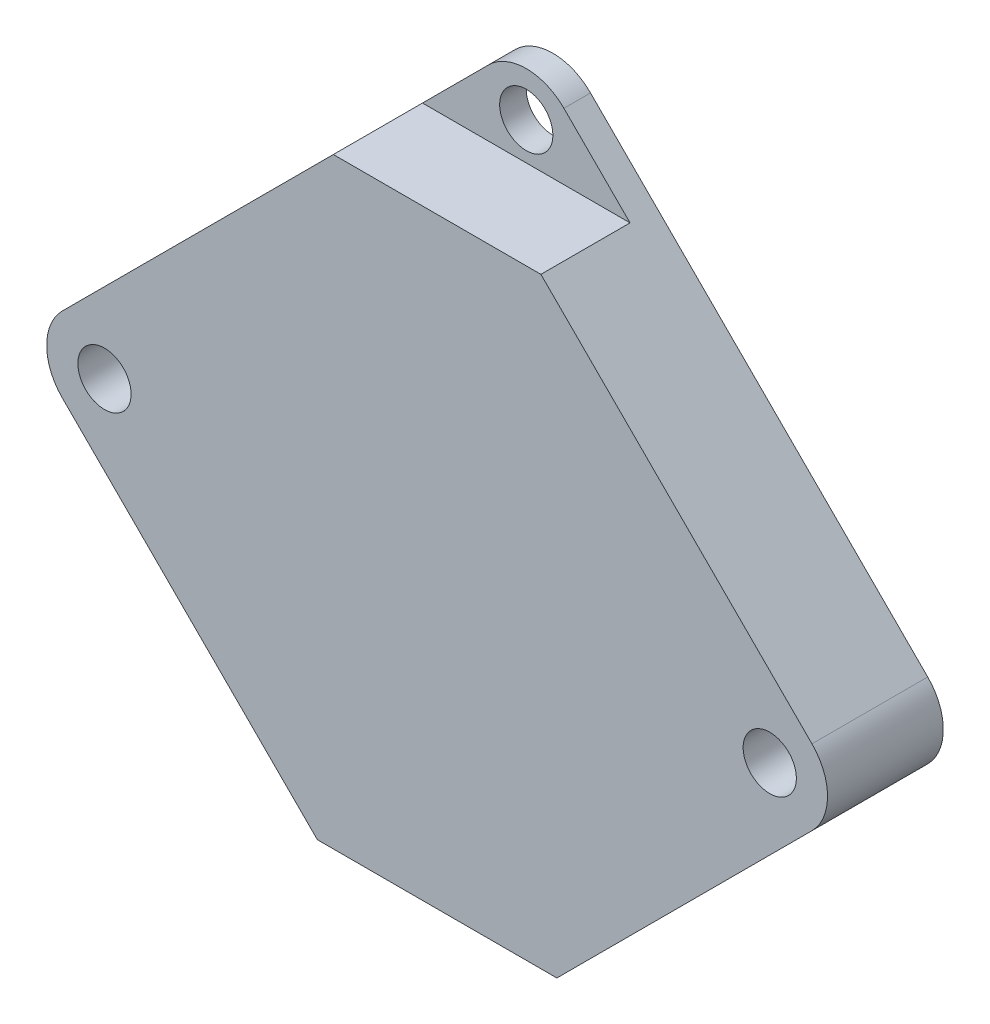
ISO-10303-21;
HEADER;
FILE_DESCRIPTION(('STEP AP214'),'2;1');
FILE_NAME('part.step','',(''),(''),'','','');
FILE_SCHEMA(('AUTOMOTIVE_DESIGN { 1 0 10303 214 1 1 1 1 }'));
ENDSEC;
DATA;
#1=APPLICATION_CONTEXT('core data for automotive mechanical design processes');
#2=APPLICATION_PROTOCOL_DEFINITION('international standard','automotive_design',2000,#1);
#3=PRODUCT_CONTEXT('',#1,'mechanical');
#4=PRODUCT('Part','Part','',(#3));
#5=PRODUCT_RELATED_PRODUCT_CATEGORY('part','',(#4));
#6=PRODUCT_DEFINITION_FORMATION('','',#4);
#7=PRODUCT_DEFINITION_CONTEXT('part definition',#1,'design');
#8=PRODUCT_DEFINITION('design','',#6,#7);
#9=PRODUCT_DEFINITION_SHAPE('','',#8);
#10=(LENGTH_UNIT() NAMED_UNIT(*) SI_UNIT(.MILLI.,.METRE.));
#11=(NAMED_UNIT(*) PLANE_ANGLE_UNIT() SI_UNIT($,.RADIAN.));
#12=(NAMED_UNIT(*) SI_UNIT($,.STERADIAN.) SOLID_ANGLE_UNIT());
#13=UNCERTAINTY_MEASURE_WITH_UNIT(LENGTH_MEASURE(1.E-05),#10,'distance_accuracy_value','');
#14=(GEOMETRIC_REPRESENTATION_CONTEXT(3) GLOBAL_UNCERTAINTY_ASSIGNED_CONTEXT((#13)) GLOBAL_UNIT_ASSIGNED_CONTEXT((#10,
#11,#12)) REPRESENTATION_CONTEXT('',''));
#15=CARTESIAN_POINT('',(0.,0.,0.));
#16=DIRECTION('',(0.,0.,1.));
#17=DIRECTION('',(1.,0.,0.));
#18=AXIS2_PLACEMENT_3D('',#15,#16,#17);
#19=CARTESIAN_POINT('',(0.,13.,4.35));
#20=DIRECTION('',(0.,0.,-1.));
#21=DIRECTION('',(-1.,0.,0.));
#22=AXIS2_PLACEMENT_3D('',#19,#20,#21);
#23=CYLINDRICAL_SURFACE('',#22,1.);
#24=CARTESIAN_POINT('',(0.,13.,0.));
#25=DIRECTION('',(0.,0.,1.));
#26=DIRECTION('',(1.,0.,0.));
#27=AXIS2_PLACEMENT_3D('',#24,#25,#26);
#28=CIRCLE('',#27,1.);
#29=CARTESIAN_POINT('',(1.,13.,0.));
#30=VERTEX_POINT('',#29);
#31=EDGE_CURVE('E438',#30,#30,#28,.T.);
#32=ORIENTED_EDGE('',*,*,#31,.F.);
#33=EDGE_LOOP('',(#32));
#34=FACE_BOUND('',#33,.T.);
#35=CARTESIAN_POINT('',(0.,13.,1.));
#36=DIRECTION('',(0.,0.,1.));
#37=DIRECTION('',(1.,0.,0.));
#38=AXIS2_PLACEMENT_3D('',#35,#36,#37);
#39=CIRCLE('',#38,1.);
#40=CARTESIAN_POINT('',(1.,13.,1.));
#41=VERTEX_POINT('',#40);
#42=EDGE_CURVE('E481',#41,#41,#39,.T.);
#43=ORIENTED_EDGE('',*,*,#42,.T.);
#44=EDGE_LOOP('',(#43));
#45=FACE_BOUND('',#44,.T.);
#46=ADVANCED_FACE('F59',(#34,#45),#23,.F.);
#47=CARTESIAN_POINT('',(0.,12.6715728752538,4.35));
#48=DIRECTION('',(0.,0.,-1.));
#49=DIRECTION('',(-1.,0.,0.));
#50=AXIS2_PLACEMENT_3D('',#47,#48,#49);
#51=CYLINDRICAL_SURFACE('',#50,2.);
#52=DIRECTION('',(0.,0.,-1.));
#53=VECTOR('',#52,1.);
#54=CARTESIAN_POINT('',(-1.41421356237309,14.0857864376269,4.35));
#55=LINE('',#54,#53);
#56=CARTESIAN_POINT('',(-1.4142135623731,14.0857864376269,1.));
#57=VERTEX_POINT('',#56);
#58=CARTESIAN_POINT('',(-1.41421356237309,14.0857864376269,0.));
#59=VERTEX_POINT('',#58);
#60=EDGE_CURVE('E263',#57,#59,#55,.T.);
#61=ORIENTED_EDGE('',*,*,#60,.F.);
#62=CARTESIAN_POINT('',(0.,12.6715728752538,1.));
#63=DIRECTION('',(0.,0.,1.));
#64=DIRECTION('',(1.,0.,0.));
#65=AXIS2_PLACEMENT_3D('',#62,#63,#64);
#66=CIRCLE('',#65,2.);
#67=CARTESIAN_POINT('',(1.4142135623731,14.0857864376269,1.));
#68=VERTEX_POINT('',#67);
#69=EDGE_CURVE('E13',#57,#68,#66,.F.);
#70=ORIENTED_EDGE('',*,*,#69,.T.);
#71=DIRECTION('',(0.,0.,-1.));
#72=VECTOR('',#71,1.);
#73=CARTESIAN_POINT('',(1.4142135623731,14.0857864376269,4.35));
#74=LINE('',#73,#72);
#75=CARTESIAN_POINT('',(1.4142135623731,14.0857864376269,0.));
#76=VERTEX_POINT('',#75);
#77=EDGE_CURVE('E272',#76,#68,#74,.F.);
#78=ORIENTED_EDGE('',*,*,#77,.F.);
#79=CARTESIAN_POINT('',(0.,12.6715728752538,0.));
#80=DIRECTION('',(0.,0.,1.));
#81=DIRECTION('',(1.,0.,0.));
#82=AXIS2_PLACEMENT_3D('',#79,#80,#81);
#83=CIRCLE('',#82,2.);
#84=EDGE_CURVE('E247',#59,#76,#83,.F.);
#85=ORIENTED_EDGE('',*,*,#84,.F.);
#86=EDGE_LOOP('',(#61,#70,#78,#85));
#87=FACE_BOUND('',#86,.T.);
#88=ADVANCED_FACE('F359',(#87),#51,.T.);
#89=CARTESIAN_POINT('',(0.,-15.5,4.35));
#90=DIRECTION('',(-0.707106781186548,0.707106781186547,0.));
#91=DIRECTION('',(-0.707106781186547,-0.707106781186548,0.));
#92=AXIS2_PLACEMENT_3D('',#89,#90,#91);
#93=PLANE('',#92);
#94=DIRECTION('',(0.,0.,-1.));
#95=VECTOR('',#94,1.);
#96=CARTESIAN_POINT('',(4.5,-11.,4.35));
#97=LINE('',#96,#95);
#98=CARTESIAN_POINT('',(4.5,-11.,4.35));
#99=VERTEX_POINT('',#98);
#100=CARTESIAN_POINT('',(4.5,-11.,0.));
#101=VERTEX_POINT('',#100);
#102=EDGE_CURVE('E409',#99,#101,#97,.T.);
#103=ORIENTED_EDGE('',*,*,#102,.T.);
#104=DIRECTION('',(0.707106781186547,0.707106781186548,0.));
#105=VECTOR('',#104,1.);
#106=CARTESIAN_POINT('',(0.,-15.5,0.));
#107=LINE('',#106,#105);
#108=CARTESIAN_POINT('',(14.0857864376269,-1.4142135623731,0.));
#109=VERTEX_POINT('',#108);
#110=EDGE_CURVE('E225',#101,#109,#107,.T.);
#111=ORIENTED_EDGE('',*,*,#110,.T.);
#112=DIRECTION('',(0.,0.,-1.));
#113=VECTOR('',#112,1.);
#114=CARTESIAN_POINT('',(14.0857864376269,-1.4142135623731,4.35));
#115=LINE('',#114,#113);
#116=CARTESIAN_POINT('',(14.0857864376269,-1.4142135623731,4.35));
#117=VERTEX_POINT('',#116);
#118=EDGE_CURVE('E219',#109,#117,#115,.F.);
#119=ORIENTED_EDGE('',*,*,#118,.T.);
#120=DIRECTION('',(0.707106781186547,0.707106781186548,0.));
#121=VECTOR('',#120,1.);
#122=CARTESIAN_POINT('',(0.,-15.5,4.35));
#123=LINE('',#122,#121);
#124=EDGE_CURVE('E221',#99,#117,#123,.T.);
#125=ORIENTED_EDGE('',*,*,#124,.F.);
#126=EDGE_LOOP('',(#103,#111,#119,#125));
#127=FACE_BOUND('',#126,.T.);
#128=ADVANCED_FACE('F365',(#127),#93,.F.);
#129=CARTESIAN_POINT('',(-15.5,0.,4.35));
#130=DIRECTION('',(0.707106781186547,0.707106781186548,0.));
#131=DIRECTION('',(-0.707106781186548,0.707106781186547,0.));
#132=AXIS2_PLACEMENT_3D('',#129,#130,#131);
#133=PLANE('',#132);
#134=DIRECTION('',(0.,0.,-1.));
#135=VECTOR('',#134,1.);
#136=CARTESIAN_POINT('',(-4.5,-11.,4.35));
#137=LINE('',#136,#135);
#138=CARTESIAN_POINT('',(-4.5,-11.,4.35));
#139=VERTEX_POINT('',#138);
#140=CARTESIAN_POINT('',(-4.5,-11.,0.));
#141=VERTEX_POINT('',#140);
#142=EDGE_CURVE('E404',#139,#141,#137,.T.);
#143=ORIENTED_EDGE('',*,*,#142,.F.);
#144=DIRECTION('',(0.707106781186548,-0.707106781186547,0.));
#145=VECTOR('',#144,1.);
#146=CARTESIAN_POINT('',(-15.5,0.,4.35));
#147=LINE('',#146,#145);
#148=CARTESIAN_POINT('',(-14.0857864376269,-1.41421356237309,4.35));
#149=VERTEX_POINT('',#148);
#150=EDGE_CURVE('E214',#149,#139,#147,.T.);
#151=ORIENTED_EDGE('',*,*,#150,.F.);
#152=DIRECTION('',(0.,0.,-1.));
#153=VECTOR('',#152,1.);
#154=CARTESIAN_POINT('',(-14.0857864376269,-1.41421356237309,4.35));
#155=LINE('',#154,#153);
#156=CARTESIAN_POINT('',(-14.0857864376269,-1.41421356237309,0.));
#157=VERTEX_POINT('',#156);
#158=EDGE_CURVE('E253',#149,#157,#155,.T.);
#159=ORIENTED_EDGE('',*,*,#158,.T.);
#160=DIRECTION('',(0.707106781186548,-0.707106781186547,0.));
#161=VECTOR('',#160,1.);
#162=CARTESIAN_POINT('',(-15.5,0.,0.));
#163=LINE('',#162,#161);
#164=EDGE_CURVE('E236',#157,#141,#163,.T.);
#165=ORIENTED_EDGE('',*,*,#164,.T.);
#166=EDGE_LOOP('',(#143,#151,#159,#165));
#167=FACE_BOUND('',#166,.T.);
#168=ADVANCED_FACE('F374',(#167),#133,.F.);
#169=CARTESIAN_POINT('',(0.,0.,4.35));
#170=DIRECTION('',(0.,0.,1.));
#171=DIRECTION('',(1.,0.,0.));
#172=AXIS2_PLACEMENT_3D('',#169,#170,#171);
#173=PLANE('',#172);
#174=DIRECTION('',(1.,0.,0.));
#175=VECTOR('',#174,1.);
#176=CARTESIAN_POINT('',(-3.9,11.6,4.35));
#177=LINE('',#176,#175);
#178=CARTESIAN_POINT('',(-3.9,11.6,4.35));
#179=VERTEX_POINT('',#178);
#180=CARTESIAN_POINT('',(3.9,11.6,4.35));
#181=VERTEX_POINT('',#180);
#182=EDGE_CURVE('E188',#179,#181,#177,.T.);
#183=ORIENTED_EDGE('',*,*,#182,.F.);
#184=DIRECTION('',(-0.707106781186547,-0.707106781186548,0.));
#185=VECTOR('',#184,1.);
#186=CARTESIAN_POINT('',(0.,15.5,4.35));
#187=LINE('',#186,#185);
#188=CARTESIAN_POINT('',(-14.0857864376269,1.4142135623731,4.35));
#189=VERTEX_POINT('',#188);
#190=EDGE_CURVE('E202',#179,#189,#187,.T.);
#191=ORIENTED_EDGE('',*,*,#190,.T.);
#192=CARTESIAN_POINT('',(-12.6715728752538,0.,4.35));
#193=DIRECTION('',(0.,0.,1.));
#194=DIRECTION('',(1.,0.,0.));
#195=AXIS2_PLACEMENT_3D('',#192,#193,#194);
#196=CIRCLE('',#195,2.);
#197=EDGE_CURVE('E260',#189,#149,#196,.T.);
#198=ORIENTED_EDGE('',*,*,#197,.T.);
#199=ORIENTED_EDGE('',*,*,#150,.T.);
#200=DIRECTION('',(-1.,0.,0.));
#201=VECTOR('',#200,1.);
#202=CARTESIAN_POINT('',(0.,-11.,4.35));
#203=LINE('',#202,#201);
#204=EDGE_CURVE('E416',#99,#139,#203,.T.);
#205=ORIENTED_EDGE('',*,*,#204,.F.);
#206=ORIENTED_EDGE('',*,*,#124,.T.);
#207=CARTESIAN_POINT('',(12.6715728752538,0.,4.35));
#208=DIRECTION('',(0.,0.,1.));
#209=DIRECTION('',(1.,0.,0.));
#210=AXIS2_PLACEMENT_3D('',#207,#208,#209);
#211=CIRCLE('',#210,2.);
#212=CARTESIAN_POINT('',(14.0857864376269,1.4142135623731,4.35));
#213=VERTEX_POINT('',#212);
#214=EDGE_CURVE('E257',#117,#213,#211,.T.);
#215=ORIENTED_EDGE('',*,*,#214,.T.);
#216=DIRECTION('',(-0.707106781186548,0.707106781186547,0.));
#217=VECTOR('',#216,1.);
#218=CARTESIAN_POINT('',(15.5,0.,4.35));
#219=LINE('',#218,#217);
#220=EDGE_CURVE('E205',#213,#181,#219,.T.);
#221=ORIENTED_EDGE('',*,*,#220,.T.);
#222=EDGE_LOOP('',(#183,#191,#198,#199,#205,#206,#215,#221));
#223=FACE_BOUND('',#222,.T.);
#224=CARTESIAN_POINT('',(-12.5,0.,4.35));
#225=DIRECTION('',(0.,0.,1.));
#226=DIRECTION('',(1.,0.,0.));
#227=AXIS2_PLACEMENT_3D('',#224,#225,#226);
#228=CIRCLE('',#227,1.);
#229=CARTESIAN_POINT('',(-11.5,0.,4.35));
#230=VERTEX_POINT('',#229);
#231=EDGE_CURVE('E229',#230,#230,#228,.T.);
#232=ORIENTED_EDGE('',*,*,#231,.F.);
#233=EDGE_LOOP('',(#232));
#234=FACE_BOUND('',#233,.T.);
#235=CARTESIAN_POINT('',(12.5,0.,4.35));
#236=DIRECTION('',(0.,0.,1.));
#237=DIRECTION('',(1.,0.,0.));
#238=AXIS2_PLACEMENT_3D('',#235,#236,#237);
#239=CIRCLE('',#238,1.);
#240=CARTESIAN_POINT('',(13.5,0.,4.35));
#241=VERTEX_POINT('',#240);
#242=EDGE_CURVE('E453',#241,#241,#239,.T.);
#243=ORIENTED_EDGE('',*,*,#242,.F.);
#244=EDGE_LOOP('',(#243));
#245=FACE_BOUND('',#244,.T.);
#246=ADVANCED_FACE('F200',(#223,#234,#245),#173,.T.);
#247=CARTESIAN_POINT('',(0.,0.,0.));
#248=DIRECTION('',(0.,0.,1.));
#249=DIRECTION('',(1.,0.,0.));
#250=AXIS2_PLACEMENT_3D('',#247,#248,#249);
#251=PLANE('',#250);
#252=ORIENTED_EDGE('',*,*,#31,.T.);
#253=EDGE_LOOP('',(#252));
#254=FACE_BOUND('',#253,.T.);
#255=CARTESIAN_POINT('',(12.5,0.,0.));
#256=DIRECTION('',(0.,0.,1.));
#257=DIRECTION('',(1.,0.,0.));
#258=AXIS2_PLACEMENT_3D('',#255,#256,#257);
#259=CIRCLE('',#258,1.);
#260=CARTESIAN_POINT('',(13.5,0.,0.));
#261=VERTEX_POINT('',#260);
#262=EDGE_CURVE('E449',#261,#261,#259,.T.);
#263=ORIENTED_EDGE('',*,*,#262,.T.);
#264=EDGE_LOOP('',(#263));
#265=FACE_BOUND('',#264,.T.);
#266=CARTESIAN_POINT('',(-12.5,0.,0.));
#267=DIRECTION('',(0.,0.,1.));
#268=DIRECTION('',(1.,0.,0.));
#269=AXIS2_PLACEMENT_3D('',#266,#267,#268);
#270=CIRCLE('',#269,1.);
#271=CARTESIAN_POINT('',(-11.5,0.,0.));
#272=VERTEX_POINT('',#271);
#273=EDGE_CURVE('E445',#272,#272,#270,.T.);
#274=ORIENTED_EDGE('',*,*,#273,.T.);
#275=EDGE_LOOP('',(#274));
#276=FACE_BOUND('',#275,.T.);
#277=CARTESIAN_POINT('',(0.,7.,0.));
#278=DIRECTION('',(0.,0.,1.));
#279=DIRECTION('',(1.,0.,0.));
#280=AXIS2_PLACEMENT_3D('',#277,#278,#279);
#281=CIRCLE('',#280,4.1);
#282=CARTESIAN_POINT('',(3.29331721297936,9.44214285714286,0.));
#283=VERTEX_POINT('',#282);
#284=CARTESIAN_POINT('',(-3.29331721297936,9.44214285714286,0.));
#285=VERTEX_POINT('',#284);
#286=EDGE_CURVE('E427',#283,#285,#281,.T.);
#287=ORIENTED_EDGE('',*,*,#286,.T.);
#288=CARTESIAN_POINT('',(0.,0.,0.));
#289=DIRECTION('',(0.,0.,1.));
#290=DIRECTION('',(1.,0.,0.));
#291=AXIS2_PLACEMENT_3D('',#288,#289,#290);
#292=CIRCLE('',#291,10.);
#293=EDGE_CURVE('E408',#285,#283,#292,.T.);
#294=ORIENTED_EDGE('',*,*,#293,.T.);
#295=EDGE_LOOP('',(#287,#294));
#296=FACE_BOUND('',#295,.T.);
#297=DIRECTION('',(-1.,0.,0.));
#298=VECTOR('',#297,1.);
#299=CARTESIAN_POINT('',(0.,-11.,0.));
#300=LINE('',#299,#298);
#301=EDGE_CURVE('E419',#101,#141,#300,.T.);
#302=ORIENTED_EDGE('',*,*,#301,.T.);
#303=ORIENTED_EDGE('',*,*,#164,.F.);
#304=CARTESIAN_POINT('',(-12.6715728752538,0.,0.));
#305=DIRECTION('',(0.,0.,1.));
#306=DIRECTION('',(1.,0.,0.));
#307=AXIS2_PLACEMENT_3D('',#304,#305,#306);
#308=CIRCLE('',#307,2.);
#309=CARTESIAN_POINT('',(-14.0857864376269,1.4142135623731,0.));
#310=VERTEX_POINT('',#309);
#311=EDGE_CURVE('E250',#157,#310,#308,.F.);
#312=ORIENTED_EDGE('',*,*,#311,.T.);
#313=DIRECTION('',(-0.707106781186547,-0.707106781186548,0.));
#314=VECTOR('',#313,1.);
#315=CARTESIAN_POINT('',(0.,15.5,0.));
#316=LINE('',#315,#314);
#317=EDGE_CURVE('E233',#59,#310,#316,.T.);
#318=ORIENTED_EDGE('',*,*,#317,.F.);
#319=ORIENTED_EDGE('',*,*,#84,.T.);
#320=DIRECTION('',(-0.707106781186548,0.707106781186547,0.));
#321=VECTOR('',#320,1.);
#322=CARTESIAN_POINT('',(15.5,0.,0.));
#323=LINE('',#322,#321);
#324=CARTESIAN_POINT('',(14.0857864376269,1.4142135623731,0.));
#325=VERTEX_POINT('',#324);
#326=EDGE_CURVE('E228',#325,#76,#323,.T.);
#327=ORIENTED_EDGE('',*,*,#326,.F.);
#328=CARTESIAN_POINT('',(12.6715728752538,0.,0.));
#329=DIRECTION('',(0.,0.,1.));
#330=DIRECTION('',(1.,0.,0.));
#331=AXIS2_PLACEMENT_3D('',#328,#329,#330);
#332=CIRCLE('',#331,2.);
#333=EDGE_CURVE('E243',#325,#109,#332,.F.);
#334=ORIENTED_EDGE('',*,*,#333,.T.);
#335=ORIENTED_EDGE('',*,*,#110,.F.);
#336=EDGE_LOOP('',(#302,#303,#312,#318,#319,#327,#334,#335));
#337=FACE_BOUND('',#336,.T.);
#338=ADVANCED_FACE('F373',(#254,#265,#276,#296,#337),#251,.F.);
#339=CARTESIAN_POINT('',(15.5,0.,4.35));
#340=DIRECTION('',(-0.707106781186547,-0.707106781186548,0.));
#341=DIRECTION('',(0.707106781186548,-0.707106781186547,0.));
#342=AXIS2_PLACEMENT_3D('',#339,#340,#341);
#343=PLANE('',#342);
#344=DIRECTION('',(0.707106781186547,-0.707106781186548,0.));
#345=VECTOR('',#344,1.);
#346=CARTESIAN_POINT('',(3.9,11.6,1.));
#347=LINE('',#346,#345);
#348=CARTESIAN_POINT('',(3.9,11.6,0.999999999999997));
#349=VERTEX_POINT('',#348);
#350=EDGE_CURVE('E75',#68,#349,#347,.T.);
#351=ORIENTED_EDGE('',*,*,#350,.T.);
#352=DIRECTION('',(0.,0.,1.));
#353=VECTOR('',#352,1.);
#354=CARTESIAN_POINT('',(3.9,11.6,-8.72066511224918));
#355=LINE('',#354,#353);
#356=EDGE_CURVE('E196',#349,#181,#355,.T.);
#357=ORIENTED_EDGE('',*,*,#356,.T.);
#358=ORIENTED_EDGE('',*,*,#220,.F.);
#359=DIRECTION('',(0.,0.,-1.));
#360=VECTOR('',#359,1.);
#361=CARTESIAN_POINT('',(14.0857864376269,1.4142135623731,4.35));
#362=LINE('',#361,#360);
#363=EDGE_CURVE('E268',#213,#325,#362,.T.);
#364=ORIENTED_EDGE('',*,*,#363,.T.);
#365=ORIENTED_EDGE('',*,*,#326,.T.);
#366=ORIENTED_EDGE('',*,*,#77,.T.);
#367=EDGE_LOOP('',(#351,#357,#358,#364,#365,#366));
#368=FACE_BOUND('',#367,.T.);
#369=ADVANCED_FACE('F377',(#368),#343,.F.);
#370=CARTESIAN_POINT('',(0.,15.5,4.35));
#371=DIRECTION('',(0.707106781186548,-0.707106781186547,0.));
#372=DIRECTION('',(0.707106781186547,0.707106781186548,0.));
#373=AXIS2_PLACEMENT_3D('',#370,#371,#372);
#374=PLANE('',#373);
#375=ORIENTED_EDGE('',*,*,#190,.F.);
#376=DIRECTION('',(0.,0.,1.));
#377=VECTOR('',#376,1.);
#378=CARTESIAN_POINT('',(-3.9,11.6,-8.72066511224918));
#379=LINE('',#378,#377);
#380=CARTESIAN_POINT('',(-3.9,11.6,1.));
#381=VERTEX_POINT('',#380);
#382=EDGE_CURVE('E185',#381,#179,#379,.T.);
#383=ORIENTED_EDGE('',*,*,#382,.F.);
#384=DIRECTION('',(0.707106781186548,0.707106781186548,0.));
#385=VECTOR('',#384,1.);
#386=CARTESIAN_POINT('',(0.,15.5,1.));
#387=LINE('',#386,#385);
#388=EDGE_CURVE('E472',#381,#57,#387,.T.);
#389=ORIENTED_EDGE('',*,*,#388,.T.);
#390=ORIENTED_EDGE('',*,*,#60,.T.);
#391=ORIENTED_EDGE('',*,*,#317,.T.);
#392=DIRECTION('',(0.,0.,-1.));
#393=VECTOR('',#392,1.);
#394=CARTESIAN_POINT('',(-14.0857864376269,1.4142135623731,4.35));
#395=LINE('',#394,#393);
#396=EDGE_CURVE('E211',#310,#189,#395,.F.);
#397=ORIENTED_EDGE('',*,*,#396,.T.);
#398=EDGE_LOOP('',(#375,#383,#389,#390,#391,#397));
#399=FACE_BOUND('',#398,.T.);
#400=ADVANCED_FACE('F208',(#399),#374,.F.);
#401=CARTESIAN_POINT('',(12.5,0.,4.35));
#402=DIRECTION('',(0.,0.,-1.));
#403=DIRECTION('',(-1.,0.,0.));
#404=AXIS2_PLACEMENT_3D('',#401,#402,#403);
#405=CYLINDRICAL_SURFACE('',#404,1.);
#406=ORIENTED_EDGE('',*,*,#242,.T.);
#407=EDGE_LOOP('',(#406));
#408=FACE_BOUND('',#407,.T.);
#409=ORIENTED_EDGE('',*,*,#262,.F.);
#410=EDGE_LOOP('',(#409));
#411=FACE_BOUND('',#410,.T.);
#412=ADVANCED_FACE('F356',(#408,#411),#405,.F.);
#413=CARTESIAN_POINT('',(-12.5,0.,4.35));
#414=DIRECTION('',(0.,0.,-1.));
#415=DIRECTION('',(-1.,0.,0.));
#416=AXIS2_PLACEMENT_3D('',#413,#414,#415);
#417=CYLINDRICAL_SURFACE('',#416,1.);
#418=ORIENTED_EDGE('',*,*,#231,.T.);
#419=EDGE_LOOP('',(#418));
#420=FACE_BOUND('',#419,.T.);
#421=ORIENTED_EDGE('',*,*,#273,.F.);
#422=EDGE_LOOP('',(#421));
#423=FACE_BOUND('',#422,.T.);
#424=ADVANCED_FACE('F351',(#420,#423),#417,.F.);
#425=CARTESIAN_POINT('',(0.,7.,2.));
#426=DIRECTION('',(0.,0.,-1.));
#427=DIRECTION('',(-1.,0.,0.));
#428=AXIS2_PLACEMENT_3D('',#425,#426,#427);
#429=CYLINDRICAL_SURFACE('',#428,4.1);
#430=ORIENTED_EDGE('',*,*,#286,.F.);
#431=DIRECTION('',(0.,0.,-1.));
#432=VECTOR('',#431,1.);
#433=CARTESIAN_POINT('',(3.29331721297936,9.44214285714286,2.));
#434=LINE('',#433,#432);
#435=CARTESIAN_POINT('',(3.29331721297936,9.44214285714286,2.));
#436=VERTEX_POINT('',#435);
#437=EDGE_CURVE('E434',#436,#283,#434,.T.);
#438=ORIENTED_EDGE('',*,*,#437,.F.);
#439=CARTESIAN_POINT('',(0.,7.,2.));
#440=DIRECTION('',(0.,0.,1.));
#441=DIRECTION('',(1.,0.,0.));
#442=AXIS2_PLACEMENT_3D('',#439,#440,#441);
#443=CIRCLE('',#442,4.1);
#444=CARTESIAN_POINT('',(-3.29331721297936,9.44214285714286,2.));
#445=VERTEX_POINT('',#444);
#446=EDGE_CURVE('E422',#436,#445,#443,.T.);
#447=ORIENTED_EDGE('',*,*,#446,.T.);
#448=DIRECTION('',(0.,0.,-1.));
#449=VECTOR('',#448,1.);
#450=CARTESIAN_POINT('',(-3.29331721297936,9.44214285714286,2.));
#451=LINE('',#450,#449);
#452=EDGE_CURVE('E426',#445,#285,#451,.T.);
#453=ORIENTED_EDGE('',*,*,#452,.T.);
#454=EDGE_LOOP('',(#430,#438,#447,#453));
#455=FACE_BOUND('',#454,.T.);
#456=ADVANCED_FACE('F349',(#455),#429,.F.);
#457=CARTESIAN_POINT('',(0.,0.,2.));
#458=DIRECTION('',(0.,0.,1.));
#459=DIRECTION('',(1.,0.,0.));
#460=AXIS2_PLACEMENT_3D('',#457,#458,#459);
#461=PLANE('',#460);
#462=DIRECTION('',(1.,0.,0.));
#463=VECTOR('',#462,1.);
#464=CARTESIAN_POINT('',(0.,10.2,2.));
#465=LINE('',#464,#463);
#466=CARTESIAN_POINT('',(-1.7,10.2,2.));
#467=VERTEX_POINT('',#466);
#468=CARTESIAN_POINT('',(1.7,10.2,2.));
#469=VERTEX_POINT('',#468);
#470=EDGE_CURVE('E68',#467,#469,#465,.T.);
#471=ORIENTED_EDGE('',*,*,#470,.F.);
#472=DIRECTION('',(0.,-1.,0.));
#473=VECTOR('',#472,1.);
#474=CARTESIAN_POINT('',(-1.7,10.2,2.));
#475=LINE('',#474,#473);
#476=CARTESIAN_POINT('',(-1.7,-9.85444062339411,2.));
#477=VERTEX_POINT('',#476);
#478=EDGE_CURVE('E305',#467,#477,#475,.T.);
#479=ORIENTED_EDGE('',*,*,#478,.T.);
#480=CARTESIAN_POINT('',(0.,0.,2.));
#481=DIRECTION('',(0.,0.,1.));
#482=DIRECTION('',(1.,0.,0.));
#483=AXIS2_PLACEMENT_3D('',#480,#481,#482);
#484=CIRCLE('',#483,10.);
#485=EDGE_CURVE('E431',#445,#477,#484,.T.);
#486=ORIENTED_EDGE('',*,*,#485,.F.);
#487=ORIENTED_EDGE('',*,*,#446,.F.);
#488=CARTESIAN_POINT('',(1.7,-9.85444062339411,2.));
#489=VERTEX_POINT('',#488);
#490=EDGE_CURVE('E298',#489,#436,#484,.T.);
#491=ORIENTED_EDGE('',*,*,#490,.F.);
#492=DIRECTION('',(0.,-1.,0.));
#493=VECTOR('',#492,1.);
#494=CARTESIAN_POINT('',(1.7,10.2,2.));
#495=LINE('',#494,#493);
#496=EDGE_CURVE('E82',#489,#469,#495,.F.);
#497=ORIENTED_EDGE('',*,*,#496,.T.);
#498=EDGE_LOOP('',(#471,#479,#486,#487,#491,#497));
#499=FACE_BOUND('',#498,.T.);
#500=ADVANCED_FACE('F296',(#499),#461,.F.);
#501=CARTESIAN_POINT('',(0.,0.,2.));
#502=DIRECTION('',(0.,0.,-1.));
#503=DIRECTION('',(-1.,0.,0.));
#504=AXIS2_PLACEMENT_3D('',#501,#502,#503);
#505=CYLINDRICAL_SURFACE('',#504,10.);
#506=CARTESIAN_POINT('',(-1.,-9.9498743710662,1.3));
#507=CARTESIAN_POINT('',(-1.0396552395193,-9.94589803978785,1.29996806365247));
#508=CARTESIAN_POINT('',(-1.07927113131844,-9.94166812943835,1.30336762048028));
#509=CARTESIAN_POINT('',(-1.15730073705886,-9.93288208853084,1.31676507680598));
#510=CARTESIAN_POINT('',(-1.195715443718,-9.92832623816604,1.32675736822925));
#511=CARTESIAN_POINT('',(-1.27030318243446,-9.91906029370943,1.35308103462264));
#512=CARTESIAN_POINT('',(-1.30647543402475,-9.91435014677812,1.3694146024139));
#513=CARTESIAN_POINT('',(-1.37555116386345,-9.90500234860819,1.40794901664544));
#514=CARTESIAN_POINT('',(-1.408455011063,-9.90036468923679,1.43014919979969));
#515=CARTESIAN_POINT('',(-1.47012877806151,-9.89139509564495,1.47985514342287));
#516=CARTESIAN_POINT('',(-1.49889090917262,-9.88706374503636,1.50737067797325));
#517=CARTESIAN_POINT('',(-1.55138283031786,-9.8789634257207,1.56692684712985));
#518=CARTESIAN_POINT('',(-1.57511180879758,-9.8751945477367,1.59896821010319));
#519=CARTESIAN_POINT('',(-1.61669418923563,-9.86847214480432,1.66645809362913));
#520=CARTESIAN_POINT('',(-1.63458309936532,-9.86551371068044,1.70188426376577));
#521=CARTESIAN_POINT('',(-1.66413172192713,-9.86057258533433,1.77529663104214));
#522=CARTESIAN_POINT('',(-1.67579618162701,-9.85858915059021,1.81328085223222));
#523=CARTESIAN_POINT('',(-1.68942956570565,-9.85625972487119,1.87627859730453));
#524=CARTESIAN_POINT('',(-1.69339066590805,-9.85557914228777,1.90086662429897));
#525=CARTESIAN_POINT('',(-1.69867557263064,-9.85466912310675,1.95029928401625));
#526=CARTESIAN_POINT('',(-1.70000290352318,-9.8544390836213,1.97514352904269));
#527=CARTESIAN_POINT('',(-1.7,-9.85444062339411,2.));
#528=B_SPLINE_CURVE_WITH_KNOTS('',3,(#506,#507,#508,#509,#510,#511,#512,#513,#514,#515,#516,
#517,#518,#519,#520,#521,#522,#523,#524,#525,#526,#527),.UNSPECIFIED.,.F.,.F.,(4,2,2,2,2,2,2,2,
2,2,4),(0.,0.119397076604131,0.238692719439505,0.358029651651008,0.477353097265175,
0.596898084952629,0.716462333656459,0.835285460988528,0.954017834227967,1.02862694228577,
1.10313614482704),.UNSPECIFIED.);
#529=CARTESIAN_POINT('',(-1.,-9.9498743710662,1.3));
#530=VERTEX_POINT('',#529);
#531=EDGE_CURVE('E300',#530,#477,#528,.T.);
#532=ORIENTED_EDGE('',*,*,#531,.F.);
#533=CARTESIAN_POINT('',(0.,0.,1.3));
#534=DIRECTION('',(0.,0.,-1.));
#535=DIRECTION('',(-1.,0.,0.));
#536=AXIS2_PLACEMENT_3D('',#533,#534,#535);
#537=CIRCLE('',#536,10.);
#538=CARTESIAN_POINT('',(1.,-9.9498743710662,1.3));
#539=VERTEX_POINT('',#538);
#540=EDGE_CURVE('E521',#539,#530,#537,.T.);
#541=ORIENTED_EDGE('',*,*,#540,.F.);
#542=CARTESIAN_POINT('',(1.7,-9.85444062339411,2.));
#543=CARTESIAN_POINT('',(1.70003509996558,-9.85442796470741,1.96098416036877));
#544=CARTESIAN_POINT('',(1.69674028811078,-9.85500286746672,1.92198301015061));
#545=CARTESIAN_POINT('',(1.6837556554112,-9.85723310634802,1.84514151442366));
#546=CARTESIAN_POINT('',(1.67407408823266,-9.85888704798713,1.8072997366068));
#547=CARTESIAN_POINT('',(1.64857584469416,-9.86318174352219,1.73379160452399));
#548=CARTESIAN_POINT('',(1.63275740135684,-9.86582278162264,1.69812588023025));
#549=CARTESIAN_POINT('',(1.59546799621339,-9.87192179100652,1.62996462228679));
#550=CARTESIAN_POINT('',(1.57399713467355,-9.8753797477988,1.59746903241718));
#551=CARTESIAN_POINT('',(1.52582986733694,-9.882936793735,1.53628581717557));
#552=CARTESIAN_POINT('',(1.49909424237821,-9.88704064525651,1.50762966480142));
#553=CARTESIAN_POINT('',(1.44125383134467,-9.89563746477398,1.45518881767487));
#554=CARTESIAN_POINT('',(1.41014801368209,-9.90013052454658,1.43140527637443));
#555=CARTESIAN_POINT('',(1.34403188053108,-9.90932411817277,1.3890978300554));
#556=CARTESIAN_POINT('',(1.30897875190014,-9.91402650847954,1.37064127648779));
#557=CARTESIAN_POINT('',(1.23626443862362,-9.92335580644878,1.33989764807441));
#558=CARTESIAN_POINT('',(1.19860469232185,-9.92798275402644,1.32760720114405));
#559=CARTESIAN_POINT('',(1.1339591622111,-9.93553394542781,1.31240858107213));
#560=CARTESIAN_POINT('',(1.10737789577043,-9.9385326371572,1.30776082877276));
#561=CARTESIAN_POINT('',(1.0538720890107,-9.94434940956898,1.30155644658184));
#562=CARTESIAN_POINT('',(1.02694802268254,-9.94716771275066,1.29999593476936));
#563=CARTESIAN_POINT('',(1.,-9.9498743710662,1.3));
#564=B_SPLINE_CURVE_WITH_KNOTS('',3,(#542,#543,#544,#545,#546,#547,#548,#549,#550,#551,#552,
#553,#554,#555,#556,#557,#558,#559,#560,#561,#562,#563),.UNSPECIFIED.,.F.,.F.,(4,2,2,2,2,2,2,2,
2,2,4),(0.,0.116882508800835,0.233614264322278,0.350379655137453,0.467142974831298,
0.584811467696569,0.702507783124963,0.821632816037786,0.940692631337484,1.02197648549472,
1.10315806755618),.UNSPECIFIED.);
#565=EDGE_CURVE('E301',#489,#539,#564,.T.);
#566=ORIENTED_EDGE('',*,*,#565,.F.);
#567=ORIENTED_EDGE('',*,*,#490,.T.);
#568=ORIENTED_EDGE('',*,*,#437,.T.);
#569=ORIENTED_EDGE('',*,*,#293,.F.);
#570=ORIENTED_EDGE('',*,*,#452,.F.);
#571=ORIENTED_EDGE('',*,*,#485,.T.);
#572=EDGE_LOOP('',(#532,#541,#566,#567,#568,#569,#570,#571));
#573=FACE_BOUND('',#572,.T.);
#574=ADVANCED_FACE('F323',(#573),#505,.F.);
#575=CARTESIAN_POINT('',(-12.6715728752538,0.,4.35));
#576=DIRECTION('',(0.,0.,-1.));
#577=DIRECTION('',(-1.,0.,0.));
#578=AXIS2_PLACEMENT_3D('',#575,#576,#577);
#579=CYLINDRICAL_SURFACE('',#578,2.);
#580=ORIENTED_EDGE('',*,*,#197,.F.);
#581=ORIENTED_EDGE('',*,*,#396,.F.);
#582=ORIENTED_EDGE('',*,*,#311,.F.);
#583=ORIENTED_EDGE('',*,*,#158,.F.);
#584=EDGE_LOOP('',(#580,#581,#582,#583));
#585=FACE_BOUND('',#584,.T.);
#586=ADVANCED_FACE('F390',(#585),#579,.T.);
#587=CARTESIAN_POINT('',(12.6715728752538,0.,4.35));
#588=DIRECTION('',(0.,0.,-1.));
#589=DIRECTION('',(-1.,0.,0.));
#590=AXIS2_PLACEMENT_3D('',#587,#588,#589);
#591=CYLINDRICAL_SURFACE('',#590,2.);
#592=ORIENTED_EDGE('',*,*,#214,.F.);
#593=ORIENTED_EDGE('',*,*,#118,.F.);
#594=ORIENTED_EDGE('',*,*,#333,.F.);
#595=ORIENTED_EDGE('',*,*,#363,.F.);
#596=EDGE_LOOP('',(#592,#593,#594,#595));
#597=FACE_BOUND('',#596,.T.);
#598=ADVANCED_FACE('F61',(#597),#591,.T.);
#599=CARTESIAN_POINT('',(0.,-11.,4.35));
#600=DIRECTION('',(0.,-1.,0.));
#601=DIRECTION('',(0.,0.,-1.));
#602=AXIS2_PLACEMENT_3D('',#599,#600,#601);
#603=PLANE('',#602);
#604=DIRECTION('',(1.,0.,0.));
#605=VECTOR('',#604,1.);
#606=CARTESIAN_POINT('',(0.,-11.,1.3));
#607=LINE('',#606,#605);
#608=CARTESIAN_POINT('',(-1.,-11.,1.3));
#609=VERTEX_POINT('',#608);
#610=CARTESIAN_POINT('',(1.,-11.,1.3));
#611=VERTEX_POINT('',#610);
#612=EDGE_CURVE('E484',#609,#611,#607,.T.);
#613=ORIENTED_EDGE('',*,*,#612,.F.);
#614=CARTESIAN_POINT('',(-1.,-11.,2.));
#615=DIRECTION('',(0.,-1.,0.));
#616=DIRECTION('',(0.,0.,-1.));
#617=AXIS2_PLACEMENT_3D('',#614,#615,#616);
#618=CIRCLE('',#617,0.7);
#619=CARTESIAN_POINT('',(-1.,-11.,2.7));
#620=VERTEX_POINT('',#619);
#621=EDGE_CURVE('E293',#620,#609,#618,.T.);
#622=ORIENTED_EDGE('',*,*,#621,.F.);
#623=DIRECTION('',(1.,0.,0.));
#624=VECTOR('',#623,1.);
#625=CARTESIAN_POINT('',(0.,-11.,2.7));
#626=LINE('',#625,#624);
#627=CARTESIAN_POINT('',(1.,-11.,2.7));
#628=VERTEX_POINT('',#627);
#629=EDGE_CURVE('E496',#620,#628,#626,.T.);
#630=ORIENTED_EDGE('',*,*,#629,.T.);
#631=CARTESIAN_POINT('',(1.,-11.,2.));
#632=DIRECTION('',(0.,-1.,0.));
#633=DIRECTION('',(0.,0.,-1.));
#634=AXIS2_PLACEMENT_3D('',#631,#632,#633);
#635=CIRCLE('',#634,0.7);
#636=EDGE_CURVE('E493',#611,#628,#635,.T.);
#637=ORIENTED_EDGE('',*,*,#636,.F.);
#638=EDGE_LOOP('',(#613,#622,#630,#637));
#639=FACE_BOUND('',#638,.T.);
#640=ORIENTED_EDGE('',*,*,#301,.F.);
#641=ORIENTED_EDGE('',*,*,#102,.F.);
#642=ORIENTED_EDGE('',*,*,#204,.T.);
#643=ORIENTED_EDGE('',*,*,#142,.T.);
#644=EDGE_LOOP('',(#640,#641,#642,#643));
#645=FACE_BOUND('',#644,.T.);
#646=ADVANCED_FACE('F344',(#639,#645),#603,.T.);
#647=CARTESIAN_POINT('',(0.,10.2,0.));
#648=DIRECTION('',(0.,-1.,0.));
#649=DIRECTION('',(0.,0.,-1.));
#650=AXIS2_PLACEMENT_3D('',#647,#648,#649);
#651=PLANE('',#650);
#652=ORIENTED_EDGE('',*,*,#470,.T.);
#653=CARTESIAN_POINT('',(1.,10.2,2.));
#654=DIRECTION('',(0.,-1.,0.));
#655=DIRECTION('',(0.,0.,-1.));
#656=AXIS2_PLACEMENT_3D('',#653,#654,#655);
#657=CIRCLE('',#656,0.7);
#658=CARTESIAN_POINT('',(1.,10.2,2.7));
#659=VERTEX_POINT('',#658);
#660=EDGE_CURVE('E281',#469,#659,#657,.T.);
#661=ORIENTED_EDGE('',*,*,#660,.T.);
#662=DIRECTION('',(1.,0.,0.));
#663=VECTOR('',#662,1.);
#664=CARTESIAN_POINT('',(0.,10.2,2.7));
#665=LINE('',#664,#663);
#666=CARTESIAN_POINT('',(-1.,10.2,2.7));
#667=VERTEX_POINT('',#666);
#668=EDGE_CURVE('E292',#667,#659,#665,.T.);
#669=ORIENTED_EDGE('',*,*,#668,.F.);
#670=CARTESIAN_POINT('',(-1.,10.2,2.));
#671=DIRECTION('',(0.,-1.,0.));
#672=DIRECTION('',(0.,0.,-1.));
#673=AXIS2_PLACEMENT_3D('',#670,#671,#672);
#674=CIRCLE('',#673,0.7);
#675=EDGE_CURVE('E284',#667,#467,#674,.T.);
#676=ORIENTED_EDGE('',*,*,#675,.T.);
#677=EDGE_LOOP('',(#652,#661,#669,#676));
#678=FACE_BOUND('',#677,.T.);
#679=ADVANCED_FACE('F279',(#678),#651,.T.);
#680=CARTESIAN_POINT('',(-1.,10.2,2.));
#681=DIRECTION('',(0.,-1.,0.));
#682=DIRECTION('',(0.,0.,-1.));
#683=AXIS2_PLACEMENT_3D('',#680,#681,#682);
#684=CYLINDRICAL_SURFACE('',#683,0.7);
#685=ORIENTED_EDGE('',*,*,#675,.F.);
#686=DIRECTION('',(0.,-1.,0.));
#687=VECTOR('',#686,1.);
#688=CARTESIAN_POINT('',(-1.,10.2,2.7));
#689=LINE('',#688,#687);
#690=EDGE_CURVE('E505',#667,#620,#689,.T.);
#691=ORIENTED_EDGE('',*,*,#690,.T.);
#692=ORIENTED_EDGE('',*,*,#621,.T.);
#693=DIRECTION('',(0.,-1.,0.));
#694=VECTOR('',#693,1.);
#695=CARTESIAN_POINT('',(-1.,10.2,1.3));
#696=LINE('',#695,#694);
#697=EDGE_CURVE('E307',#530,#609,#696,.T.);
#698=ORIENTED_EDGE('',*,*,#697,.F.);
#699=ORIENTED_EDGE('',*,*,#531,.T.);
#700=ORIENTED_EDGE('',*,*,#478,.F.);
#701=EDGE_LOOP('',(#685,#691,#692,#698,#699,#700));
#702=FACE_BOUND('',#701,.T.);
#703=ADVANCED_FACE('F327',(#702),#684,.F.);
#704=CARTESIAN_POINT('',(1.,10.2,2.));
#705=DIRECTION('',(0.,-1.,0.));
#706=DIRECTION('',(0.,0.,-1.));
#707=AXIS2_PLACEMENT_3D('',#704,#705,#706);
#708=CYLINDRICAL_SURFACE('',#707,0.7);
#709=ORIENTED_EDGE('',*,*,#565,.T.);
#710=DIRECTION('',(0.,-1.,0.));
#711=VECTOR('',#710,1.);
#712=CARTESIAN_POINT('',(1.,10.2,1.3));
#713=LINE('',#712,#711);
#714=EDGE_CURVE('E490',#539,#611,#713,.T.);
#715=ORIENTED_EDGE('',*,*,#714,.T.);
#716=ORIENTED_EDGE('',*,*,#636,.T.);
#717=DIRECTION('',(0.,-1.,0.));
#718=VECTOR('',#717,1.);
#719=CARTESIAN_POINT('',(1.,10.2,2.7));
#720=LINE('',#719,#718);
#721=EDGE_CURVE('E290',#659,#628,#720,.T.);
#722=ORIENTED_EDGE('',*,*,#721,.F.);
#723=ORIENTED_EDGE('',*,*,#660,.F.);
#724=ORIENTED_EDGE('',*,*,#496,.F.);
#725=EDGE_LOOP('',(#709,#715,#716,#722,#723,#724));
#726=FACE_BOUND('',#725,.T.);
#727=ADVANCED_FACE('F288',(#726),#708,.F.);
#728=CARTESIAN_POINT('',(0.,10.2,1.3));
#729=DIRECTION('',(0.,0.,-1.));
#730=DIRECTION('',(-1.,0.,0.));
#731=AXIS2_PLACEMENT_3D('',#728,#729,#730);
#732=PLANE('',#731);
#733=ORIENTED_EDGE('',*,*,#540,.T.);
#734=ORIENTED_EDGE('',*,*,#697,.T.);
#735=ORIENTED_EDGE('',*,*,#612,.T.);
#736=ORIENTED_EDGE('',*,*,#714,.F.);
#737=EDGE_LOOP('',(#733,#734,#735,#736));
#738=FACE_BOUND('',#737,.T.);
#739=ADVANCED_FACE('F336',(#738),#732,.F.);
#740=CARTESIAN_POINT('',(0.,10.2,2.7));
#741=DIRECTION('',(0.,0.,-1.));
#742=DIRECTION('',(-1.,0.,0.));
#743=AXIS2_PLACEMENT_3D('',#740,#741,#742);
#744=PLANE('',#743);
#745=ORIENTED_EDGE('',*,*,#629,.F.);
#746=ORIENTED_EDGE('',*,*,#690,.F.);
#747=ORIENTED_EDGE('',*,*,#668,.T.);
#748=ORIENTED_EDGE('',*,*,#721,.T.);
#749=EDGE_LOOP('',(#745,#746,#747,#748));
#750=FACE_BOUND('',#749,.T.);
#751=ADVANCED_FACE('F334',(#750),#744,.T.);
#752=CARTESIAN_POINT('',(-3.9,11.6,-8.72066511224918));
#753=DIRECTION('',(0.,-1.,0.));
#754=DIRECTION('',(0.,0.,-1.));
#755=AXIS2_PLACEMENT_3D('',#752,#753,#754);
#756=PLANE('',#755);
#757=DIRECTION('',(-1.,0.,0.));
#758=VECTOR('',#757,1.);
#759=CARTESIAN_POINT('',(-3.9,11.6,1.));
#760=LINE('',#759,#758);
#761=EDGE_CURVE('E190',#349,#381,#760,.T.);
#762=ORIENTED_EDGE('',*,*,#761,.T.);
#763=ORIENTED_EDGE('',*,*,#382,.T.);
#764=ORIENTED_EDGE('',*,*,#182,.T.);
#765=ORIENTED_EDGE('',*,*,#356,.F.);
#766=EDGE_LOOP('',(#762,#763,#764,#765));
#767=FACE_BOUND('',#766,.T.);
#768=ADVANCED_FACE('F187',(#767),#756,.F.);
#769=CARTESIAN_POINT('',(0.,0.,1.));
#770=DIRECTION('',(0.,0.,1.));
#771=DIRECTION('',(1.,0.,0.));
#772=AXIS2_PLACEMENT_3D('',#769,#770,#771);
#773=PLANE('',#772);
#774=ORIENTED_EDGE('',*,*,#42,.F.);
#775=EDGE_LOOP('',(#774));
#776=FACE_BOUND('',#775,.T.);
#777=ORIENTED_EDGE('',*,*,#388,.F.);
#778=ORIENTED_EDGE('',*,*,#761,.F.);
#779=ORIENTED_EDGE('',*,*,#350,.F.);
#780=ORIENTED_EDGE('',*,*,#69,.F.);
#781=EDGE_LOOP('',(#777,#778,#779,#780));
#782=FACE_BOUND('',#781,.T.);
#783=ADVANCED_FACE('F525',(#776,#782),#773,.T.);
#784=CLOSED_SHELL('',(#46,#88,#128,#168,#246,#338,#369,#400,#412,#424,#456,#500,#574,#586,#598,
#646,#679,#703,#727,#739,#751,#768,#783));
#785=MANIFOLD_SOLID_BREP('B2',#784);
#786=ADVANCED_BREP_SHAPE_REPRESENTATION('',(#18,#785),#14);
#787=SHAPE_DEFINITION_REPRESENTATION(#9,#786);
ENDSEC;
END-ISO-10303-21;
